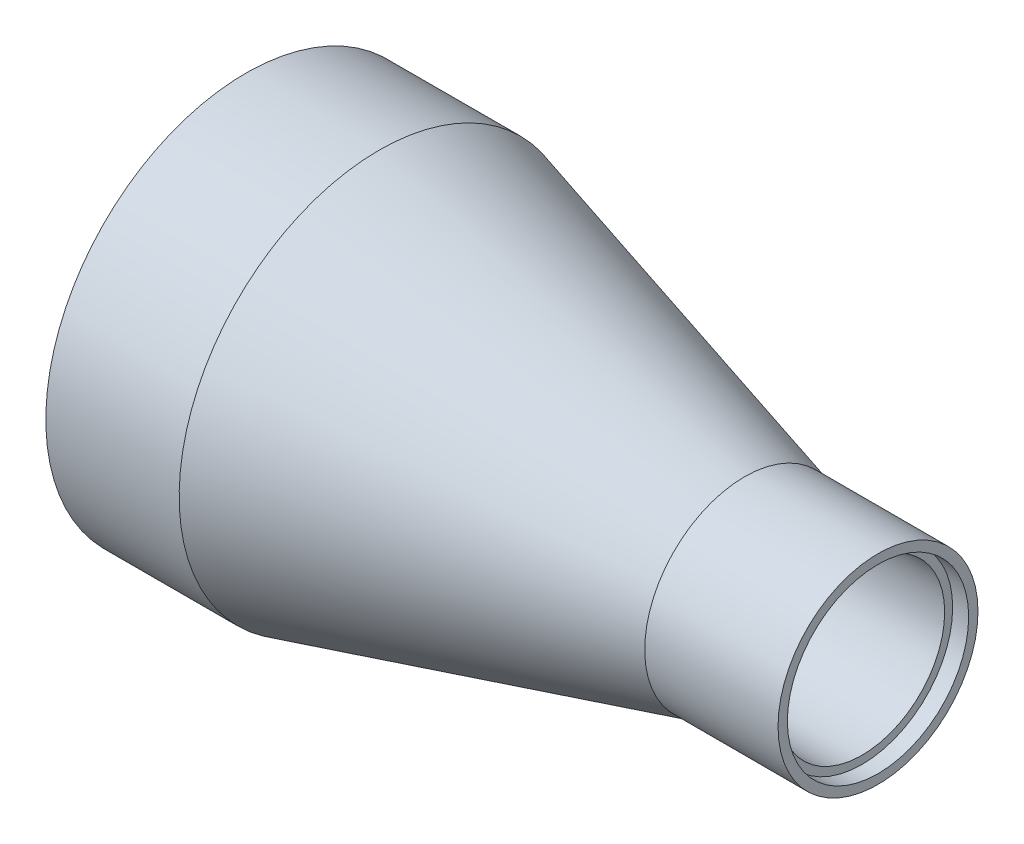
ISO-10303-21;
HEADER;
FILE_DESCRIPTION(('STEP AP214'),'2;1');
FILE_NAME('part.step','',(''),(''),'','','');
FILE_SCHEMA(('AUTOMOTIVE_DESIGN { 1 0 10303 214 1 1 1 1 }'));
ENDSEC;
DATA;
#1=APPLICATION_CONTEXT('core data for automotive mechanical design processes');
#2=APPLICATION_PROTOCOL_DEFINITION('international standard','automotive_design',2000,#1);
#3=PRODUCT_CONTEXT('',#1,'mechanical');
#4=PRODUCT('Part','Part','',(#3));
#5=PRODUCT_RELATED_PRODUCT_CATEGORY('part','',(#4));
#6=PRODUCT_DEFINITION_FORMATION('','',#4);
#7=PRODUCT_DEFINITION_CONTEXT('part definition',#1,'design');
#8=PRODUCT_DEFINITION('design','',#6,#7);
#9=PRODUCT_DEFINITION_SHAPE('','',#8);
#10=(LENGTH_UNIT() NAMED_UNIT(*) SI_UNIT(.MILLI.,.METRE.));
#11=(NAMED_UNIT(*) PLANE_ANGLE_UNIT() SI_UNIT($,.RADIAN.));
#12=(NAMED_UNIT(*) SI_UNIT($,.STERADIAN.) SOLID_ANGLE_UNIT());
#13=UNCERTAINTY_MEASURE_WITH_UNIT(LENGTH_MEASURE(1.E-05),#10,'distance_accuracy_value','');
#14=(GEOMETRIC_REPRESENTATION_CONTEXT(3) GLOBAL_UNCERTAINTY_ASSIGNED_CONTEXT((#13)) GLOBAL_UNIT_ASSIGNED_CONTEXT((#10,
#11,#12)) REPRESENTATION_CONTEXT('',''));
#15=CARTESIAN_POINT('',(0.,0.,0.));
#16=DIRECTION('',(0.,0.,1.));
#17=DIRECTION('',(1.,0.,0.));
#18=AXIS2_PLACEMENT_3D('',#15,#16,#17);
#19=CARTESIAN_POINT('',(53.0005394978668,0.,0.));
#20=DIRECTION('',(1.,0.,0.));
#21=DIRECTION('',(0.,0.,-1.));
#22=AXIS2_PLACEMENT_3D('',#19,#20,#21);
#23=CYLINDRICAL_SURFACE('',#22,7.874);
#24=CARTESIAN_POINT('',(58.6994000000003,0.,0.));
#25=DIRECTION('',(1.,0.,0.));
#26=DIRECTION('',(0.,0.,-1.));
#27=AXIS2_PLACEMENT_3D('',#24,#25,#26);
#28=CIRCLE('',#27,7.874);
#29=CARTESIAN_POINT('',(58.6994000000003,0.,-7.874));
#30=VERTEX_POINT('',#29);
#31=EDGE_CURVE('E18',#30,#30,#28,.F.);
#32=ORIENTED_EDGE('',*,*,#31,.F.);
#33=EDGE_LOOP('',(#32));
#34=FACE_BOUND('',#33,.T.);
#35=CARTESIAN_POINT('',(47.3016789971863,0.,0.));
#36=DIRECTION('',(-1.,0.,0.));
#37=DIRECTION('',(0.,1.,0.));
#38=AXIS2_PLACEMENT_3D('',#35,#36,#37);
#39=CIRCLE('',#38,7.87400000531202);
#40=CARTESIAN_POINT('',(47.3016789971863,7.87400000531202,0.));
#41=VERTEX_POINT('',#40);
#42=EDGE_CURVE('E41',#41,#41,#39,.T.);
#43=ORIENTED_EDGE('',*,*,#42,.T.);
#44=EDGE_LOOP('',(#43));
#45=FACE_BOUND('',#44,.T.);
#46=ADVANCED_FACE('F15',(#34,#45),#23,.F.);
#47=CARTESIAN_POINT('',(58.6994000000003,8.255,0.));
#48=DIRECTION('',(1.,0.,0.));
#49=DIRECTION('',(0.,0.,-1.));
#50=AXIS2_PLACEMENT_3D('',#47,#48,#49);
#51=PLANE('',#50);
#52=ORIENTED_EDGE('',*,*,#31,.T.);
#53=EDGE_LOOP('',(#52));
#54=FACE_BOUND('',#53,.T.);
#55=CARTESIAN_POINT('',(58.6994000000003,0.,0.));
#56=DIRECTION('',(1.,0.,0.));
#57=DIRECTION('',(0.,0.,-1.));
#58=AXIS2_PLACEMENT_3D('',#55,#56,#57);
#59=CIRCLE('',#58,8.63599999999998);
#60=CARTESIAN_POINT('',(58.6994000000003,0.,-8.63599999999998));
#61=VERTEX_POINT('',#60);
#62=EDGE_CURVE('E38',#61,#61,#59,.T.);
#63=ORIENTED_EDGE('',*,*,#62,.T.);
#64=EDGE_LOOP('',(#63));
#65=FACE_BOUND('',#64,.T.);
#66=ADVANCED_FACE('F58',(#54,#65),#51,.T.);
#67=CARTESIAN_POINT('',(12.4782789942799,0.,0.));
#68=DIRECTION('',(-1.,0.,0.));
#69=DIRECTION('',(0.,0.,1.));
#70=AXIS2_PLACEMENT_3D('',#67,#68,#69);
#71=CONICAL_SURFACE('',#70,17.398999994688,0.2669925152044);
#72=ORIENTED_EDGE('',*,*,#42,.F.);
#73=EDGE_LOOP('',(#72));
#74=FACE_BOUND('',#73,.T.);
#75=CARTESIAN_POINT('',(12.4782789957329,0.,0.));
#76=DIRECTION('',(1.,0.,0.));
#77=DIRECTION('',(0.,0.,-1.));
#78=AXIS2_PLACEMENT_3D('',#75,#76,#77);
#79=CIRCLE('',#78,17.399);
#80=CARTESIAN_POINT('',(12.4782789957329,0.,-17.399));
#81=VERTEX_POINT('',#80);
#82=EDGE_CURVE('E34',#81,#81,#79,.F.);
#83=ORIENTED_EDGE('',*,*,#82,.T.);
#84=EDGE_LOOP('',(#83));
#85=FACE_BOUND('',#84,.T.);
#86=ADVANCED_FACE('F63',(#74,#85),#71,.F.);
#87=CARTESIAN_POINT('',(59.4614000000004,0.,0.));
#88=DIRECTION('',(1.,0.,0.));
#89=DIRECTION('',(0.,0.,-1.));
#90=AXIS2_PLACEMENT_3D('',#87,#88,#89);
#91=CYLINDRICAL_SURFACE('',#90,8.63599999999998);
#92=CARTESIAN_POINT('',(60.2234000000005,0.,0.));
#93=DIRECTION('',(1.,0.,0.));
#94=DIRECTION('',(0.,0.,-1.));
#95=AXIS2_PLACEMENT_3D('',#92,#93,#94);
#96=CIRCLE('',#95,8.63599999999998);
#97=CARTESIAN_POINT('',(60.2234000000005,0.,-8.63599999999998));
#98=VERTEX_POINT('',#97);
#99=EDGE_CURVE('E37',#98,#98,#96,.F.);
#100=ORIENTED_EDGE('',*,*,#99,.F.);
#101=EDGE_LOOP('',(#100));
#102=FACE_BOUND('',#101,.T.);
#103=ORIENTED_EDGE('',*,*,#62,.F.);
#104=EDGE_LOOP('',(#103));
#105=FACE_BOUND('',#104,.T.);
#106=ADVANCED_FACE('F60',(#102,#105),#91,.F.);
#107=CARTESIAN_POINT('',(6.23913949786646,0.,0.));
#108=DIRECTION('',(1.,0.,0.));
#109=DIRECTION('',(0.,0.,-1.));
#110=AXIS2_PLACEMENT_3D('',#107,#108,#109);
#111=CYLINDRICAL_SURFACE('',#110,17.399);
#112=ORIENTED_EDGE('',*,*,#82,.F.);
#113=EDGE_LOOP('',(#112));
#114=FACE_BOUND('',#113,.T.);
#115=CARTESIAN_POINT('',(0.,0.,0.));
#116=DIRECTION('',(1.,0.,0.));
#117=DIRECTION('',(0.,0.,-1.));
#118=AXIS2_PLACEMENT_3D('',#115,#116,#117);
#119=CIRCLE('',#118,17.399);
#120=CARTESIAN_POINT('',(0.,0.,-17.399));
#121=VERTEX_POINT('',#120);
#122=EDGE_CURVE('E51',#121,#121,#119,.T.);
#123=ORIENTED_EDGE('',*,*,#122,.F.);
#124=EDGE_LOOP('',(#123));
#125=FACE_BOUND('',#124,.T.);
#126=ADVANCED_FACE('F62',(#114,#125),#111,.F.);
#127=CARTESIAN_POINT('',(60.2234000000005,9.08049999999998,0.));
#128=DIRECTION('',(1.,0.,0.));
#129=DIRECTION('',(0.,0.,-1.));
#130=AXIS2_PLACEMENT_3D('',#127,#128,#129);
#131=PLANE('',#130);
#132=ORIENTED_EDGE('',*,*,#99,.T.);
#133=EDGE_LOOP('',(#132));
#134=FACE_BOUND('',#133,.T.);
#135=CARTESIAN_POINT('',(60.2234000000005,0.,0.));
#136=DIRECTION('',(1.,0.,0.));
#137=DIRECTION('',(0.,0.,-1.));
#138=AXIS2_PLACEMENT_3D('',#135,#136,#137);
#139=CIRCLE('',#138,9.525);
#140=CARTESIAN_POINT('',(60.2234000000005,0.,-9.525));
#141=VERTEX_POINT('',#140);
#142=EDGE_CURVE('E48',#141,#141,#139,.F.);
#143=ORIENTED_EDGE('',*,*,#142,.F.);
#144=EDGE_LOOP('',(#143));
#145=FACE_BOUND('',#144,.T.);
#146=ADVANCED_FACE('F71',(#134,#145),#131,.T.);
#147=CARTESIAN_POINT('',(0.,18.2245,0.));
#148=DIRECTION('',(-1.,0.,0.));
#149=DIRECTION('',(0.,0.,1.));
#150=AXIS2_PLACEMENT_3D('',#147,#148,#149);
#151=PLANE('',#150);
#152=ORIENTED_EDGE('',*,*,#122,.T.);
#153=EDGE_LOOP('',(#152));
#154=FACE_BOUND('',#153,.T.);
#155=CARTESIAN_POINT('',(0.,0.,0.));
#156=DIRECTION('',(1.,0.,0.));
#157=DIRECTION('',(0.,0.,-1.));
#158=AXIS2_PLACEMENT_3D('',#155,#156,#157);
#159=CIRCLE('',#158,19.05);
#160=CARTESIAN_POINT('',(0.,0.,-19.05));
#161=VERTEX_POINT('',#160);
#162=EDGE_CURVE('E27',#161,#161,#159,.T.);
#163=ORIENTED_EDGE('',*,*,#162,.F.);
#164=EDGE_LOOP('',(#163));
#165=FACE_BOUND('',#164,.T.);
#166=ADVANCED_FACE('F91',(#154,#165),#151,.T.);
#167=CARTESIAN_POINT('',(53.8734000000004,0.,0.));
#168=DIRECTION('',(1.,0.,0.));
#169=DIRECTION('',(0.,0.,-1.));
#170=AXIS2_PLACEMENT_3D('',#167,#168,#169);
#171=CYLINDRICAL_SURFACE('',#170,9.525);
#172=CARTESIAN_POINT('',(47.5234000014534,0.,0.));
#173=DIRECTION('',(-1.,0.,0.));
#174=DIRECTION('',(0.,1.,0.));
#175=AXIS2_PLACEMENT_3D('',#172,#173,#174);
#176=CIRCLE('',#175,9.52500000531202);
#177=CARTESIAN_POINT('',(47.5234000014534,9.52500000531202,0.));
#178=VERTEX_POINT('',#177);
#179=EDGE_CURVE('E22',#178,#178,#176,.T.);
#180=ORIENTED_EDGE('',*,*,#179,.F.);
#181=EDGE_LOOP('',(#180));
#182=FACE_BOUND('',#181,.T.);
#183=ORIENTED_EDGE('',*,*,#142,.T.);
#184=EDGE_LOOP('',(#183));
#185=FACE_BOUND('',#184,.T.);
#186=ADVANCED_FACE('F84',(#182,#185),#171,.T.);
#187=CARTESIAN_POINT('',(6.35,0.,0.));
#188=DIRECTION('',(1.,0.,0.));
#189=DIRECTION('',(0.,0.,-1.));
#190=AXIS2_PLACEMENT_3D('',#187,#188,#189);
#191=CYLINDRICAL_SURFACE('',#190,19.05);
#192=ORIENTED_EDGE('',*,*,#162,.T.);
#193=EDGE_LOOP('',(#192));
#194=FACE_BOUND('',#193,.T.);
#195=CARTESIAN_POINT('',(12.699999998547,0.,0.));
#196=DIRECTION('',(-1.,0.,0.));
#197=DIRECTION('',(0.,1.,0.));
#198=AXIS2_PLACEMENT_3D('',#195,#196,#197);
#199=CIRCLE('',#198,19.049999994688);
#200=CARTESIAN_POINT('',(12.699999998547,19.049999994688,0.));
#201=VERTEX_POINT('',#200);
#202=EDGE_CURVE('E10',#201,#201,#199,.F.);
#203=ORIENTED_EDGE('',*,*,#202,.F.);
#204=EDGE_LOOP('',(#203));
#205=FACE_BOUND('',#204,.T.);
#206=ADVANCED_FACE('F79',(#194,#205),#191,.T.);
#207=CARTESIAN_POINT('',(12.699999998547,0.,0.));
#208=DIRECTION('',(-1.,0.,0.));
#209=DIRECTION('',(0.,0.,1.));
#210=AXIS2_PLACEMENT_3D('',#207,#208,#209);
#211=CONICAL_SURFACE('',#210,19.049999994688,0.2669925152044);
#212=ORIENTED_EDGE('',*,*,#202,.T.);
#213=EDGE_LOOP('',(#212));
#214=FACE_BOUND('',#213,.T.);
#215=ORIENTED_EDGE('',*,*,#179,.T.);
#216=EDGE_LOOP('',(#215));
#217=FACE_BOUND('',#216,.T.);
#218=ADVANCED_FACE('F77',(#214,#217),#211,.T.);
#219=CLOSED_SHELL('',(#46,#66,#86,#106,#126,#146,#166,#186,#206,#218));
#220=MANIFOLD_SOLID_BREP('B1',#219);
#221=ADVANCED_BREP_SHAPE_REPRESENTATION('',(#18,#220),#14);
#222=SHAPE_DEFINITION_REPRESENTATION(#9,#221);
ENDSEC;
END-ISO-10303-21;
